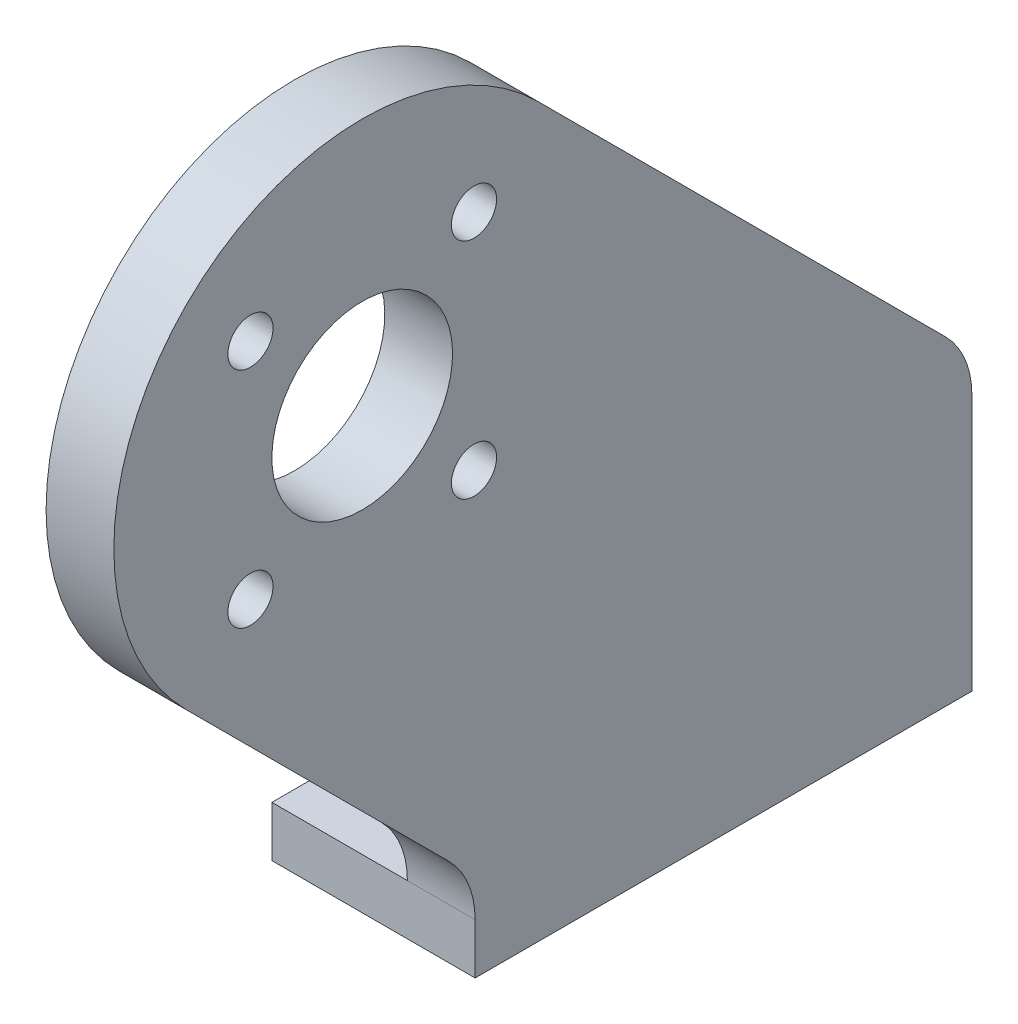
ISO-10303-21;
HEADER;
FILE_DESCRIPTION(('STEP AP214'),'2;1');
FILE_NAME('part.step','',(''),(''),'','','');
FILE_SCHEMA(('AUTOMOTIVE_DESIGN { 1 0 10303 214 1 1 1 1 }'));
ENDSEC;
DATA;
#1=APPLICATION_CONTEXT('core data for automotive mechanical design processes');
#2=APPLICATION_PROTOCOL_DEFINITION('international standard','automotive_design',2000,#1);
#3=PRODUCT_CONTEXT('',#1,'mechanical');
#4=PRODUCT('Part','Part','',(#3));
#5=PRODUCT_RELATED_PRODUCT_CATEGORY('part','',(#4));
#6=PRODUCT_DEFINITION_FORMATION('','',#4);
#7=PRODUCT_DEFINITION_CONTEXT('part definition',#1,'design');
#8=PRODUCT_DEFINITION('design','',#6,#7);
#9=PRODUCT_DEFINITION_SHAPE('','',#8);
#10=(LENGTH_UNIT() NAMED_UNIT(*) SI_UNIT(.MILLI.,.METRE.));
#11=(NAMED_UNIT(*) PLANE_ANGLE_UNIT() SI_UNIT($,.RADIAN.));
#12=(NAMED_UNIT(*) SI_UNIT($,.STERADIAN.) SOLID_ANGLE_UNIT());
#13=UNCERTAINTY_MEASURE_WITH_UNIT(LENGTH_MEASURE(1.E-05),#10,'distance_accuracy_value','');
#14=(GEOMETRIC_REPRESENTATION_CONTEXT(3) GLOBAL_UNCERTAINTY_ASSIGNED_CONTEXT((#13)) GLOBAL_UNIT_ASSIGNED_CONTEXT((#10,
#11,#12)) REPRESENTATION_CONTEXT('',''));
#15=CARTESIAN_POINT('',(0.,0.,0.));
#16=DIRECTION('',(0.,0.,1.));
#17=DIRECTION('',(1.,0.,0.));
#18=AXIS2_PLACEMENT_3D('',#15,#16,#17);
#19=CARTESIAN_POINT('',(58.5,-18.900505063,-2.));
#20=DIRECTION('',(1.,0.,0.));
#21=DIRECTION('',(0.,1.,0.));
#22=AXIS2_PLACEMENT_3D('',#19,#20,#21);
#23=CYLINDRICAL_SURFACE('',#22,4.);
#24=CARTESIAN_POINT('',(58.5,-18.900505063,-2.));
#25=DIRECTION('',(1.,0.,0.));
#26=DIRECTION('',(0.,1.,0.));
#27=AXIS2_PLACEMENT_3D('',#24,#25,#26);
#28=CIRCLE('',#27,4.);
#29=CARTESIAN_POINT('',(58.5,-18.900505063,-6.));
#30=VERTEX_POINT('',#29);
#31=CARTESIAN_POINT('',(58.5,-16.07207793875,-4.82842712475));
#32=VERTEX_POINT('',#31);
#33=EDGE_CURVE('E135',#30,#32,#28,.T.);
#34=ORIENTED_EDGE('',*,*,#33,.T.);
#35=DIRECTION('',(1.,0.,0.));
#36=VECTOR('',#35,1.);
#37=CARTESIAN_POINT('',(60.,-16.072077939,-4.828427125));
#38=LINE('',#37,#36);
#39=CARTESIAN_POINT('',(61.5,-16.0720779361714,-4.82842712681032));
#40=VERTEX_POINT('',#39);
#41=EDGE_CURVE('E201',#32,#40,#38,.T.);
#42=ORIENTED_EDGE('',*,*,#41,.T.);
#43=CARTESIAN_POINT('',(61.5,-18.900505063,-2.));
#44=DIRECTION('',(1.,0.,0.));
#45=DIRECTION('',(0.,1.,0.));
#46=AXIS2_PLACEMENT_3D('',#43,#44,#45);
#47=CIRCLE('',#46,4.);
#48=CARTESIAN_POINT('',(61.5,-18.900505063,-6.));
#49=VERTEX_POINT('',#48);
#50=EDGE_CURVE('E113',#49,#40,#47,.T.);
#51=ORIENTED_EDGE('',*,*,#50,.F.);
#52=DIRECTION('',(1.,0.,0.));
#53=VECTOR('',#52,1.);
#54=CARTESIAN_POINT('',(57.,-18.900505063,-6.));
#55=LINE('',#54,#53);
#56=EDGE_CURVE('E193',#30,#49,#55,.T.);
#57=ORIENTED_EDGE('',*,*,#56,.F.);
#58=EDGE_LOOP('',(#34,#42,#51,#57));
#59=FACE_BOUND('',#58,.T.);
#60=ADVANCED_FACE('F17',(#59),#23,.T.);
#61=CARTESIAN_POINT('',(61.5,-16.072077939,-4.828427125));
#62=DIRECTION('',(0.,-0.707106781186547,0.707106781186547));
#63=DIRECTION('',(0.,0.707106781186547,0.707106781186547));
#64=AXIS2_PLACEMENT_3D('',#61,#62,#63);
#65=PLANE('',#64);
#66=DIRECTION('',(0.,0.707106781186547,0.707106781186547));
#67=VECTOR('',#66,1.);
#68=CARTESIAN_POINT('',(58.5,-16.072077939,-4.828427125));
#69=LINE('',#68,#67);
#70=CARTESIAN_POINT('',(58.5,1.97817459217873,13.2218254061267));
#71=VERTEX_POINT('',#70);
#72=EDGE_CURVE('E138',#32,#71,#69,.T.);
#73=ORIENTED_EDGE('',*,*,#72,.T.);
#74=DIRECTION('',(-1.,0.,0.));
#75=VECTOR('',#74,1.);
#76=CARTESIAN_POINT('',(60.,1.97817459135746,13.2218254052534));
#77=LINE('',#76,#75);
#78=CARTESIAN_POINT('',(61.5,1.97817459355712,13.2218254061735));
#79=VERTEX_POINT('',#78);
#80=EDGE_CURVE('E203',#71,#79,#77,.F.);
#81=ORIENTED_EDGE('',*,*,#80,.T.);
#82=DIRECTION('',(0.,0.707106781056989,0.707106781316107));
#83=VECTOR('',#82,1.);
#84=CARTESIAN_POINT('',(61.5,-16.0720779385982,-4.828427133876));
#85=LINE('',#84,#83);
#86=EDGE_CURVE('E114',#40,#79,#85,.T.);
#87=ORIENTED_EDGE('',*,*,#86,.F.);
#88=ORIENTED_EDGE('',*,*,#41,.F.);
#89=EDGE_LOOP('',(#73,#81,#87,#88));
#90=FACE_BOUND('',#89,.T.);
#91=ADVANCED_FACE('F301',(#90),#65,.F.);
#92=CARTESIAN_POINT('',(61.5,-5.8,21.));
#93=DIRECTION('',(-1.,0.,0.));
#94=DIRECTION('',(0.,-1.,0.));
#95=AXIS2_PLACEMENT_3D('',#92,#93,#94);
#96=CYLINDRICAL_SURFACE('',#95,11.);
#97=ORIENTED_EDGE('',*,*,#80,.F.);
#98=CARTESIAN_POINT('',(58.5,-5.8,21.));
#99=DIRECTION('',(-1.,0.,0.));
#100=DIRECTION('',(0.,-1.,0.));
#101=AXIS2_PLACEMENT_3D('',#98,#99,#100);
#102=CIRCLE('',#101,11.);
#103=CARTESIAN_POINT('',(58.5,-13.578174593,28.778174593));
#104=VERTEX_POINT('',#103);
#105=EDGE_CURVE('E142',#71,#104,#102,.F.);
#106=ORIENTED_EDGE('',*,*,#105,.T.);
#107=DIRECTION('',(1.,0.,0.));
#108=VECTOR('',#107,1.);
#109=CARTESIAN_POINT('',(60.,-13.578174593,28.778174593));
#110=LINE('',#109,#108);
#111=CARTESIAN_POINT('',(61.5,-13.5781745834232,28.7781745877387));
#112=VERTEX_POINT('',#111);
#113=EDGE_CURVE('E99',#104,#112,#110,.T.);
#114=ORIENTED_EDGE('',*,*,#113,.T.);
#115=CARTESIAN_POINT('',(61.5,-5.8,21.));
#116=DIRECTION('',(-1.,0.,0.));
#117=DIRECTION('',(0.,-1.,0.));
#118=AXIS2_PLACEMENT_3D('',#115,#116,#117);
#119=CIRCLE('',#118,11.);
#120=EDGE_CURVE('E106',#79,#112,#119,.F.);
#121=ORIENTED_EDGE('',*,*,#120,.F.);
#122=EDGE_LOOP('',(#97,#106,#114,#121));
#123=FACE_BOUND('',#122,.T.);
#124=ADVANCED_FACE('F298',(#123),#96,.T.);
#125=CARTESIAN_POINT('',(61.5,-13.578174593,28.778174593));
#126=DIRECTION('',(0.,0.707106781186548,-0.707106781186547));
#127=DIRECTION('',(0.,-0.707106781186547,-0.707106781186548));
#128=AXIS2_PLACEMENT_3D('',#125,#126,#127);
#129=PLANE('',#128);
#130=DIRECTION('',(0.,-0.707106781186547,-0.707106781186548));
#131=VECTOR('',#130,1.);
#132=CARTESIAN_POINT('',(58.5,-13.578174593,28.778174593));
#133=LINE('',#132,#131);
#134=CARTESIAN_POINT('',(58.5,-25.1847763120801,17.1715728744199));
#135=VERTEX_POINT('',#134);
#136=EDGE_CURVE('E94',#104,#135,#133,.T.);
#137=ORIENTED_EDGE('',*,*,#136,.T.);
#138=DIRECTION('',(1.,0.,0.));
#139=VECTOR('',#138,1.);
#140=CARTESIAN_POINT('',(60.,-25.1847763131602,17.1715728738398));
#141=LINE('',#140,#139);
#142=CARTESIAN_POINT('',(61.5,-25.1847763086655,17.171572869436));
#143=VERTEX_POINT('',#142);
#144=EDGE_CURVE('E89',#143,#135,#141,.F.);
#145=ORIENTED_EDGE('',*,*,#144,.F.);
#146=DIRECTION('',(0.,-0.70710678157887,-0.707106780794225));
#147=VECTOR('',#146,1.);
#148=CARTESIAN_POINT('',(61.5,-13.5781745778557,28.778174578468));
#149=LINE('',#148,#147);
#150=EDGE_CURVE('E92',#112,#143,#149,.T.);
#151=ORIENTED_EDGE('',*,*,#150,.F.);
#152=ORIENTED_EDGE('',*,*,#113,.F.);
#153=EDGE_LOOP('',(#137,#145,#151,#152));
#154=FACE_BOUND('',#153,.T.);
#155=ADVANCED_FACE('F91',(#154),#129,.F.);
#156=CARTESIAN_POINT('',(61.5,-28.013203436,20.));
#157=DIRECTION('',(-1.,0.,0.));
#158=DIRECTION('',(0.,-1.,0.));
#159=AXIS2_PLACEMENT_3D('',#156,#157,#158);
#160=CYLINDRICAL_SURFACE('',#159,3.99999999965183);
#161=DIRECTION('',(-1.,0.,0.));
#162=VECTOR('',#161,1.);
#163=CARTESIAN_POINT('',(57.,-28.013203436,16.));
#164=LINE('',#163,#162);
#165=CARTESIAN_POINT('',(61.5,-28.013203436,16.));
#166=VERTEX_POINT('',#165);
#167=CARTESIAN_POINT('',(58.5000000015,-28.013203436,16.0000000001741));
#168=VERTEX_POINT('',#167);
#169=EDGE_CURVE('E112',#166,#168,#164,.T.);
#170=ORIENTED_EDGE('',*,*,#169,.F.);
#171=CARTESIAN_POINT('',(61.5,-28.013203436,20.));
#172=DIRECTION('',(-1.,0.,0.));
#173=DIRECTION('',(0.,-1.,0.));
#174=AXIS2_PLACEMENT_3D('',#171,#172,#173);
#175=CIRCLE('',#174,3.99999999965183);
#176=EDGE_CURVE('E21',#143,#166,#175,.T.);
#177=ORIENTED_EDGE('',*,*,#176,.F.);
#178=ORIENTED_EDGE('',*,*,#144,.T.);
#179=CARTESIAN_POINT('',(58.5,-28.013203436,20.));
#180=DIRECTION('',(-1.,0.,0.));
#181=DIRECTION('',(0.,-1.,0.));
#182=AXIS2_PLACEMENT_3D('',#179,#180,#181);
#183=CIRCLE('',#182,3.99999999965183);
#184=EDGE_CURVE('E146',#135,#168,#183,.T.);
#185=ORIENTED_EDGE('',*,*,#184,.T.);
#186=EDGE_LOOP('',(#170,#177,#178,#185));
#187=FACE_BOUND('',#186,.T.);
#188=ADVANCED_FACE('F111',(#187),#160,.F.);
#189=CARTESIAN_POINT('',(61.5,-10.749747468,25.949747468));
#190=DIRECTION('',(-1.,0.,0.));
#191=DIRECTION('',(0.,-1.,0.));
#192=AXIS2_PLACEMENT_3D('',#189,#190,#191);
#193=CYLINDRICAL_SURFACE('',#192,1.);
#194=CARTESIAN_POINT('',(58.5,-10.749747468,25.949747468));
#195=DIRECTION('',(-1.,0.,0.));
#196=DIRECTION('',(0.,-1.,0.));
#197=AXIS2_PLACEMENT_3D('',#194,#195,#196);
#198=CIRCLE('',#197,1.);
#199=CARTESIAN_POINT('',(58.5,-11.749747468,25.949747468));
#200=VERTEX_POINT('',#199);
#201=EDGE_CURVE('E148',#200,#200,#198,.T.);
#202=ORIENTED_EDGE('',*,*,#201,.T.);
#203=EDGE_LOOP('',(#202));
#204=FACE_BOUND('',#203,.T.);
#205=CARTESIAN_POINT('',(61.5,-10.749747468,25.949747468));
#206=DIRECTION('',(-1.,0.,0.));
#207=DIRECTION('',(0.,-1.,0.));
#208=AXIS2_PLACEMENT_3D('',#205,#206,#207);
#209=CIRCLE('',#208,1.);
#210=CARTESIAN_POINT('',(61.5,-11.749747468,25.949747468));
#211=VERTEX_POINT('',#210);
#212=EDGE_CURVE('E108',#211,#211,#209,.T.);
#213=ORIENTED_EDGE('',*,*,#212,.F.);
#214=EDGE_LOOP('',(#213));
#215=FACE_BOUND('',#214,.T.);
#216=ADVANCED_FACE('F291',(#204,#215),#193,.F.);
#217=CARTESIAN_POINT('',(61.5,-0.850252532,25.949747468));
#218=DIRECTION('',(-1.,0.,0.));
#219=DIRECTION('',(0.,-1.,0.));
#220=AXIS2_PLACEMENT_3D('',#217,#218,#219);
#221=CYLINDRICAL_SURFACE('',#220,1.);
#222=CARTESIAN_POINT('',(58.5,-0.85025253200001,25.949747468));
#223=DIRECTION('',(-1.,0.,0.));
#224=DIRECTION('',(0.,-1.,0.));
#225=AXIS2_PLACEMENT_3D('',#222,#223,#224);
#226=CIRCLE('',#225,1.);
#227=CARTESIAN_POINT('',(58.5,-1.85025253200001,25.949747468));
#228=VERTEX_POINT('',#227);
#229=EDGE_CURVE('E151',#228,#228,#226,.T.);
#230=ORIENTED_EDGE('',*,*,#229,.T.);
#231=EDGE_LOOP('',(#230));
#232=FACE_BOUND('',#231,.T.);
#233=CARTESIAN_POINT('',(61.5,-0.850252532,25.949747468));
#234=DIRECTION('',(-1.,0.,0.));
#235=DIRECTION('',(0.,-1.,0.));
#236=AXIS2_PLACEMENT_3D('',#233,#234,#235);
#237=CIRCLE('',#236,1.);
#238=CARTESIAN_POINT('',(61.5,-1.850252532,25.949747468));
#239=VERTEX_POINT('',#238);
#240=EDGE_CURVE('E129',#239,#239,#237,.T.);
#241=ORIENTED_EDGE('',*,*,#240,.F.);
#242=EDGE_LOOP('',(#241));
#243=FACE_BOUND('',#242,.T.);
#244=ADVANCED_FACE('F287',(#232,#243),#221,.F.);
#245=CARTESIAN_POINT('',(61.5,-0.850252532,16.050252532));
#246=DIRECTION('',(-1.,0.,0.));
#247=DIRECTION('',(0.,-1.,0.));
#248=AXIS2_PLACEMENT_3D('',#245,#246,#247);
#249=CYLINDRICAL_SURFACE('',#248,1.);
#250=CARTESIAN_POINT('',(58.5,-0.85025253200001,16.050252532));
#251=DIRECTION('',(-1.,0.,0.));
#252=DIRECTION('',(0.,-1.,0.));
#253=AXIS2_PLACEMENT_3D('',#250,#251,#252);
#254=CIRCLE('',#253,1.);
#255=CARTESIAN_POINT('',(58.5,-1.85025253200001,16.050252532));
#256=VERTEX_POINT('',#255);
#257=EDGE_CURVE('E154',#256,#256,#254,.T.);
#258=ORIENTED_EDGE('',*,*,#257,.T.);
#259=EDGE_LOOP('',(#258));
#260=FACE_BOUND('',#259,.T.);
#261=CARTESIAN_POINT('',(61.5,-0.850252532,16.050252532));
#262=DIRECTION('',(-1.,0.,0.));
#263=DIRECTION('',(0.,-1.,0.));
#264=AXIS2_PLACEMENT_3D('',#261,#262,#263);
#265=CIRCLE('',#264,1.);
#266=CARTESIAN_POINT('',(61.5,-1.850252532,16.050252532));
#267=VERTEX_POINT('',#266);
#268=EDGE_CURVE('E126',#267,#267,#265,.T.);
#269=ORIENTED_EDGE('',*,*,#268,.F.);
#270=EDGE_LOOP('',(#269));
#271=FACE_BOUND('',#270,.T.);
#272=ADVANCED_FACE('F283',(#260,#271),#249,.F.);
#273=CARTESIAN_POINT('',(61.5,-5.8,21.));
#274=DIRECTION('',(-1.,0.,0.));
#275=DIRECTION('',(0.,-1.,0.));
#276=AXIS2_PLACEMENT_3D('',#273,#274,#275);
#277=CYLINDRICAL_SURFACE('',#276,4.);
#278=CARTESIAN_POINT('',(58.5,-5.8,21.));
#279=DIRECTION('',(-1.,0.,0.));
#280=DIRECTION('',(0.,-1.,0.));
#281=AXIS2_PLACEMENT_3D('',#278,#279,#280);
#282=CIRCLE('',#281,4.);
#283=CARTESIAN_POINT('',(58.5,-9.8,21.));
#284=VERTEX_POINT('',#283);
#285=EDGE_CURVE('E157',#284,#284,#282,.T.);
#286=ORIENTED_EDGE('',*,*,#285,.T.);
#287=EDGE_LOOP('',(#286));
#288=FACE_BOUND('',#287,.T.);
#289=CARTESIAN_POINT('',(61.5,-5.8,21.));
#290=DIRECTION('',(-1.,0.,0.));
#291=DIRECTION('',(0.,-1.,0.));
#292=AXIS2_PLACEMENT_3D('',#289,#290,#291);
#293=CIRCLE('',#292,4.);
#294=CARTESIAN_POINT('',(61.5,-9.8,21.));
#295=VERTEX_POINT('',#294);
#296=EDGE_CURVE('E132',#295,#295,#293,.T.);
#297=ORIENTED_EDGE('',*,*,#296,.F.);
#298=EDGE_LOOP('',(#297));
#299=FACE_BOUND('',#298,.T.);
#300=ADVANCED_FACE('F279',(#288,#299),#277,.F.);
#301=CARTESIAN_POINT('',(61.5,-10.749747468,16.050252532));
#302=DIRECTION('',(-1.,0.,0.));
#303=DIRECTION('',(0.,-1.,0.));
#304=AXIS2_PLACEMENT_3D('',#301,#302,#303);
#305=CYLINDRICAL_SURFACE('',#304,1.);
#306=CARTESIAN_POINT('',(58.5,-10.749747468,16.050252532));
#307=DIRECTION('',(-1.,0.,0.));
#308=DIRECTION('',(0.,-1.,0.));
#309=AXIS2_PLACEMENT_3D('',#306,#307,#308);
#310=CIRCLE('',#309,1.);
#311=CARTESIAN_POINT('',(58.5,-11.749747468,16.050252532));
#312=VERTEX_POINT('',#311);
#313=EDGE_CURVE('E160',#312,#312,#310,.T.);
#314=ORIENTED_EDGE('',*,*,#313,.T.);
#315=EDGE_LOOP('',(#314));
#316=FACE_BOUND('',#315,.T.);
#317=CARTESIAN_POINT('',(61.5,-10.749747468,16.050252532));
#318=DIRECTION('',(-1.,0.,0.));
#319=DIRECTION('',(0.,-1.,0.));
#320=AXIS2_PLACEMENT_3D('',#317,#318,#319);
#321=CIRCLE('',#320,1.);
#322=CARTESIAN_POINT('',(61.5,-11.749747468,16.050252532));
#323=VERTEX_POINT('',#322);
#324=EDGE_CURVE('E123',#323,#323,#321,.T.);
#325=ORIENTED_EDGE('',*,*,#324,.F.);
#326=EDGE_LOOP('',(#325));
#327=FACE_BOUND('',#326,.T.);
#328=ADVANCED_FACE('F276',(#316,#327),#305,.F.);
#329=CARTESIAN_POINT('',(61.5,5.412696938,32.228));
#330=DIRECTION('',(1.,0.,0.));
#331=DIRECTION('',(0.,-1.,0.));
#332=AXIS2_PLACEMENT_3D('',#329,#330,#331);
#333=PLANE('',#332);
#334=ORIENTED_EDGE('',*,*,#296,.T.);
#335=EDGE_LOOP('',(#334));
#336=FACE_BOUND('',#335,.T.);
#337=ORIENTED_EDGE('',*,*,#240,.T.);
#338=EDGE_LOOP('',(#337));
#339=FACE_BOUND('',#338,.T.);
#340=ORIENTED_EDGE('',*,*,#268,.T.);
#341=EDGE_LOOP('',(#340));
#342=FACE_BOUND('',#341,.T.);
#343=ORIENTED_EDGE('',*,*,#324,.T.);
#344=EDGE_LOOP('',(#343));
#345=FACE_BOUND('',#344,.T.);
#346=ORIENTED_EDGE('',*,*,#212,.T.);
#347=EDGE_LOOP('',(#346));
#348=FACE_BOUND('',#347,.T.);
#349=ORIENTED_EDGE('',*,*,#120,.T.);
#350=ORIENTED_EDGE('',*,*,#150,.T.);
#351=ORIENTED_EDGE('',*,*,#176,.T.);
#352=DIRECTION('',(0.,1.,0.));
#353=VECTOR('',#352,1.);
#354=CARTESIAN_POINT('',(61.5,-29.1313465895,16.));
#355=LINE('',#354,#353);
#356=CARTESIAN_POINT('',(61.5,-30.249489743,15.9999999999713));
#357=VERTEX_POINT('',#356);
#358=EDGE_CURVE('E177',#357,#166,#355,.T.);
#359=ORIENTED_EDGE('',*,*,#358,.F.);
#360=DIRECTION('',(0.,0.,1.));
#361=VECTOR('',#360,1.);
#362=CARTESIAN_POINT('',(61.5,-30.249489743,5.));
#363=LINE('',#362,#361);
#364=CARTESIAN_POINT('',(61.5,-30.249489743,-6.));
#365=VERTEX_POINT('',#364);
#366=EDGE_CURVE('E168',#365,#357,#363,.T.);
#367=ORIENTED_EDGE('',*,*,#366,.F.);
#368=DIRECTION('',(0.,-1.,0.));
#369=VECTOR('',#368,1.);
#370=CARTESIAN_POINT('',(61.5,-24.574997403,-6.));
#371=LINE('',#370,#369);
#372=EDGE_CURVE('E191',#49,#365,#371,.T.);
#373=ORIENTED_EDGE('',*,*,#372,.F.);
#374=ORIENTED_EDGE('',*,*,#50,.T.);
#375=ORIENTED_EDGE('',*,*,#86,.T.);
#376=EDGE_LOOP('',(#349,#350,#351,#359,#367,#373,#374,#375));
#377=FACE_BOUND('',#376,.T.);
#378=ADVANCED_FACE('F103',(#336,#339,#342,#345,#348,#377),#333,.T.);
#379=CARTESIAN_POINT('',(61.5,-30.249489743,16.));
#380=DIRECTION('',(0.,0.,1.));
#381=DIRECTION('',(0.,1.,0.));
#382=AXIS2_PLACEMENT_3D('',#379,#380,#381);
#383=PLANE('',#382);
#384=DIRECTION('',(-1.,0.,0.));
#385=VECTOR('',#384,1.);
#386=CARTESIAN_POINT('',(57.,-30.249489743,16.));
#387=LINE('',#386,#385);
#388=CARTESIAN_POINT('',(52.5,-30.249489743,16.));
#389=VERTEX_POINT('',#388);
#390=EDGE_CURVE('E163',#357,#389,#387,.T.);
#391=ORIENTED_EDGE('',*,*,#390,.F.);
#392=ORIENTED_EDGE('',*,*,#358,.T.);
#393=ORIENTED_EDGE('',*,*,#169,.T.);
#394=DIRECTION('',(-1.,0.,0.));
#395=VECTOR('',#394,1.);
#396=CARTESIAN_POINT('',(55.5,-28.013203436,16.));
#397=LINE('',#396,#395);
#398=CARTESIAN_POINT('',(52.5,-28.013203436,16.));
#399=VERTEX_POINT('',#398);
#400=EDGE_CURVE('E167',#168,#399,#397,.T.);
#401=ORIENTED_EDGE('',*,*,#400,.T.);
#402=DIRECTION('',(0.,-1.,0.));
#403=VECTOR('',#402,1.);
#404=CARTESIAN_POINT('',(52.5,-29.1313465895,16.));
#405=LINE('',#404,#403);
#406=EDGE_CURVE('E179',#399,#389,#405,.T.);
#407=ORIENTED_EDGE('',*,*,#406,.T.);
#408=EDGE_LOOP('',(#391,#392,#393,#401,#407));
#409=FACE_BOUND('',#408,.T.);
#410=ADVANCED_FACE('F249',(#409),#383,.T.);
#411=CARTESIAN_POINT('',(52.5,-30.249489743,16.));
#412=DIRECTION('',(1.,0.,0.));
#413=DIRECTION('',(0.,0.,-1.));
#414=AXIS2_PLACEMENT_3D('',#411,#412,#413);
#415=PLANE('',#414);
#416=DIRECTION('',(0.,1.,0.));
#417=VECTOR('',#416,1.);
#418=CARTESIAN_POINT('',(52.5,-24.574997403,-6.));
#419=LINE('',#418,#417);
#420=CARTESIAN_POINT('',(52.5,-30.249489743,-6.));
#421=VERTEX_POINT('',#420);
#422=CARTESIAN_POINT('',(52.5,-28.013203436,-6.));
#423=VERTEX_POINT('',#422);
#424=EDGE_CURVE('E139',#421,#423,#419,.T.);
#425=ORIENTED_EDGE('',*,*,#424,.F.);
#426=DIRECTION('',(0.,0.,-1.));
#427=VECTOR('',#426,1.);
#428=CARTESIAN_POINT('',(52.5,-30.249489743,5.));
#429=LINE('',#428,#427);
#430=EDGE_CURVE('E183',#389,#421,#429,.T.);
#431=ORIENTED_EDGE('',*,*,#430,.F.);
#432=ORIENTED_EDGE('',*,*,#406,.F.);
#433=DIRECTION('',(0.,0.,-1.));
#434=VECTOR('',#433,1.);
#435=CARTESIAN_POINT('',(52.5,-28.013203436,5.));
#436=LINE('',#435,#434);
#437=EDGE_CURVE('E215',#399,#423,#436,.T.);
#438=ORIENTED_EDGE('',*,*,#437,.T.);
#439=EDGE_LOOP('',(#425,#431,#432,#438));
#440=FACE_BOUND('',#439,.T.);
#441=ADVANCED_FACE('F245',(#440),#415,.F.);
#442=CARTESIAN_POINT('',(52.5,-18.900505063,-6.));
#443=DIRECTION('',(0.,0.,-1.));
#444=DIRECTION('',(1.,0.,0.));
#445=AXIS2_PLACEMENT_3D('',#442,#443,#444);
#446=PLANE('',#445);
#447=ORIENTED_EDGE('',*,*,#424,.T.);
#448=DIRECTION('',(1.,0.,0.));
#449=VECTOR('',#448,1.);
#450=CARTESIAN_POINT('',(55.5,-28.013203436,-6.));
#451=LINE('',#450,#449);
#452=CARTESIAN_POINT('',(58.5,-28.013203436,-6.));
#453=VERTEX_POINT('',#452);
#454=EDGE_CURVE('E218',#423,#453,#451,.T.);
#455=ORIENTED_EDGE('',*,*,#454,.T.);
#456=DIRECTION('',(0.,1.,0.));
#457=VECTOR('',#456,1.);
#458=CARTESIAN_POINT('',(58.5,-11.3069621075,-6.));
#459=LINE('',#458,#457);
#460=EDGE_CURVE('E36',#453,#30,#459,.T.);
#461=ORIENTED_EDGE('',*,*,#460,.T.);
#462=ORIENTED_EDGE('',*,*,#56,.T.);
#463=ORIENTED_EDGE('',*,*,#372,.T.);
#464=DIRECTION('',(1.,0.,0.));
#465=VECTOR('',#464,1.);
#466=CARTESIAN_POINT('',(57.,-30.249489743,-6.));
#467=LINE('',#466,#465);
#468=EDGE_CURVE('E188',#421,#365,#467,.T.);
#469=ORIENTED_EDGE('',*,*,#468,.F.);
#470=EDGE_LOOP('',(#447,#455,#461,#462,#463,#469));
#471=FACE_BOUND('',#470,.T.);
#472=ADVANCED_FACE('F236',(#471),#446,.T.);
#473=CARTESIAN_POINT('',(58.5,-28.013203436,32.228));
#474=DIRECTION('',(1.,0.,0.));
#475=DIRECTION('',(0.,0.,-1.));
#476=AXIS2_PLACEMENT_3D('',#473,#474,#475);
#477=PLANE('',#476);
#478=ORIENTED_EDGE('',*,*,#313,.F.);
#479=EDGE_LOOP('',(#478));
#480=FACE_BOUND('',#479,.T.);
#481=ORIENTED_EDGE('',*,*,#285,.F.);
#482=EDGE_LOOP('',(#481));
#483=FACE_BOUND('',#482,.T.);
#484=ORIENTED_EDGE('',*,*,#257,.F.);
#485=EDGE_LOOP('',(#484));
#486=FACE_BOUND('',#485,.T.);
#487=ORIENTED_EDGE('',*,*,#229,.F.);
#488=EDGE_LOOP('',(#487));
#489=FACE_BOUND('',#488,.T.);
#490=ORIENTED_EDGE('',*,*,#201,.F.);
#491=EDGE_LOOP('',(#490));
#492=FACE_BOUND('',#491,.T.);
#493=DIRECTION('',(0.,0.,1.));
#494=VECTOR('',#493,1.);
#495=CARTESIAN_POINT('',(58.5,-28.013203436,5.));
#496=LINE('',#495,#494);
#497=EDGE_CURVE('E172',#453,#168,#496,.T.);
#498=ORIENTED_EDGE('',*,*,#497,.T.);
#499=ORIENTED_EDGE('',*,*,#184,.F.);
#500=ORIENTED_EDGE('',*,*,#136,.F.);
#501=ORIENTED_EDGE('',*,*,#105,.F.);
#502=ORIENTED_EDGE('',*,*,#72,.F.);
#503=ORIENTED_EDGE('',*,*,#33,.F.);
#504=ORIENTED_EDGE('',*,*,#460,.F.);
#505=EDGE_LOOP('',(#498,#499,#500,#501,#502,#503,#504));
#506=FACE_BOUND('',#505,.T.);
#507=ADVANCED_FACE('F250',(#480,#483,#486,#489,#492,#506),#477,.F.);
#508=CARTESIAN_POINT('',(55.5,-30.249489743,-3.041960108));
#509=DIRECTION('',(0.,1.,0.));
#510=DIRECTION('',(0.,0.,1.));
#511=AXIS2_PLACEMENT_3D('',#508,#509,#510);
#512=CYLINDRICAL_SURFACE('',#511,1.);
#513=CARTESIAN_POINT('',(55.5,-30.249489743,-3.041960108));
#514=DIRECTION('',(0.,1.,0.));
#515=DIRECTION('',(0.,0.,1.));
#516=AXIS2_PLACEMENT_3D('',#513,#514,#515);
#517=CIRCLE('',#516,1.);
#518=CARTESIAN_POINT('',(55.5,-30.249489743,-2.041960108));
#519=VERTEX_POINT('',#518);
#520=EDGE_CURVE('E164',#519,#519,#517,.T.);
#521=ORIENTED_EDGE('',*,*,#520,.F.);
#522=EDGE_LOOP('',(#521));
#523=FACE_BOUND('',#522,.T.);
#524=CARTESIAN_POINT('',(55.5,-28.013203436,-3.041960108));
#525=DIRECTION('',(0.,1.,0.));
#526=DIRECTION('',(0.,0.,1.));
#527=AXIS2_PLACEMENT_3D('',#524,#525,#526);
#528=CIRCLE('',#527,1.);
#529=CARTESIAN_POINT('',(55.5,-28.013203436,-2.041960108));
#530=VERTEX_POINT('',#529);
#531=EDGE_CURVE('E169',#530,#530,#528,.T.);
#532=ORIENTED_EDGE('',*,*,#531,.T.);
#533=EDGE_LOOP('',(#532));
#534=FACE_BOUND('',#533,.T.);
#535=ADVANCED_FACE('F252',(#523,#534),#512,.F.);
#536=CARTESIAN_POINT('',(52.5,-30.249489743,16.));
#537=DIRECTION('',(0.,-1.,0.));
#538=DIRECTION('',(0.,0.,-1.));
#539=AXIS2_PLACEMENT_3D('',#536,#537,#538);
#540=PLANE('',#539);
#541=ORIENTED_EDGE('',*,*,#520,.T.);
#542=EDGE_LOOP('',(#541));
#543=FACE_BOUND('',#542,.T.);
#544=CARTESIAN_POINT('',(55.5,-30.249489743,13.));
#545=DIRECTION('',(0.,1.,0.));
#546=DIRECTION('',(0.,0.,1.));
#547=AXIS2_PLACEMENT_3D('',#544,#545,#546);
#548=CIRCLE('',#547,0.999999999999999);
#549=CARTESIAN_POINT('',(55.5,-30.249489743,14.));
#550=VERTEX_POINT('',#549);
#551=EDGE_CURVE('E27',#550,#550,#548,.F.);
#552=ORIENTED_EDGE('',*,*,#551,.F.);
#553=EDGE_LOOP('',(#552));
#554=FACE_BOUND('',#553,.T.);
#555=ORIENTED_EDGE('',*,*,#468,.T.);
#556=ORIENTED_EDGE('',*,*,#366,.T.);
#557=ORIENTED_EDGE('',*,*,#390,.T.);
#558=ORIENTED_EDGE('',*,*,#430,.T.);
#559=EDGE_LOOP('',(#555,#556,#557,#558));
#560=FACE_BOUND('',#559,.T.);
#561=ADVANCED_FACE('F260',(#543,#554,#560),#540,.T.);
#562=CARTESIAN_POINT('',(52.5,-28.013203436,16.));
#563=DIRECTION('',(0.,-1.,0.));
#564=DIRECTION('',(0.,0.,-1.));
#565=AXIS2_PLACEMENT_3D('',#562,#563,#564);
#566=PLANE('',#565);
#567=CARTESIAN_POINT('',(55.5,-28.013203436,13.));
#568=DIRECTION('',(0.,1.,0.));
#569=DIRECTION('',(0.,0.,1.));
#570=AXIS2_PLACEMENT_3D('',#567,#568,#569);
#571=CIRCLE('',#570,0.999999999999999);
#572=CARTESIAN_POINT('',(55.5,-28.013203436,14.));
#573=VERTEX_POINT('',#572);
#574=EDGE_CURVE('E11',#573,#573,#571,.T.);
#575=ORIENTED_EDGE('',*,*,#574,.F.);
#576=EDGE_LOOP('',(#575));
#577=FACE_BOUND('',#576,.T.);
#578=ORIENTED_EDGE('',*,*,#531,.F.);
#579=EDGE_LOOP('',(#578));
#580=FACE_BOUND('',#579,.T.);
#581=ORIENTED_EDGE('',*,*,#454,.F.);
#582=ORIENTED_EDGE('',*,*,#437,.F.);
#583=ORIENTED_EDGE('',*,*,#400,.F.);
#584=ORIENTED_EDGE('',*,*,#497,.F.);
#585=EDGE_LOOP('',(#581,#582,#583,#584));
#586=FACE_BOUND('',#585,.T.);
#587=ADVANCED_FACE('F19',(#577,#580,#586),#566,.F.);
#588=CARTESIAN_POINT('',(55.5,-30.249489743,13.));
#589=DIRECTION('',(0.,1.,0.));
#590=DIRECTION('',(0.,0.,1.));
#591=AXIS2_PLACEMENT_3D('',#588,#589,#590);
#592=CYLINDRICAL_SURFACE('',#591,0.999999999999999);
#593=ORIENTED_EDGE('',*,*,#574,.T.);
#594=EDGE_LOOP('',(#593));
#595=FACE_BOUND('',#594,.T.);
#596=ORIENTED_EDGE('',*,*,#551,.T.);
#597=EDGE_LOOP('',(#596));
#598=FACE_BOUND('',#597,.T.);
#599=ADVANCED_FACE('F266',(#595,#598),#592,.F.);
#600=CLOSED_SHELL('',(#60,#91,#124,#155,#188,#216,#244,#272,#300,#328,#378,#410,#441,#472,#507,
#535,#561,#587,#599));
#601=MANIFOLD_SOLID_BREP('B1',#600);
#602=ADVANCED_BREP_SHAPE_REPRESENTATION('',(#18,#601),#14);
#603=SHAPE_DEFINITION_REPRESENTATION(#9,#602);
ENDSEC;
END-ISO-10303-21;
